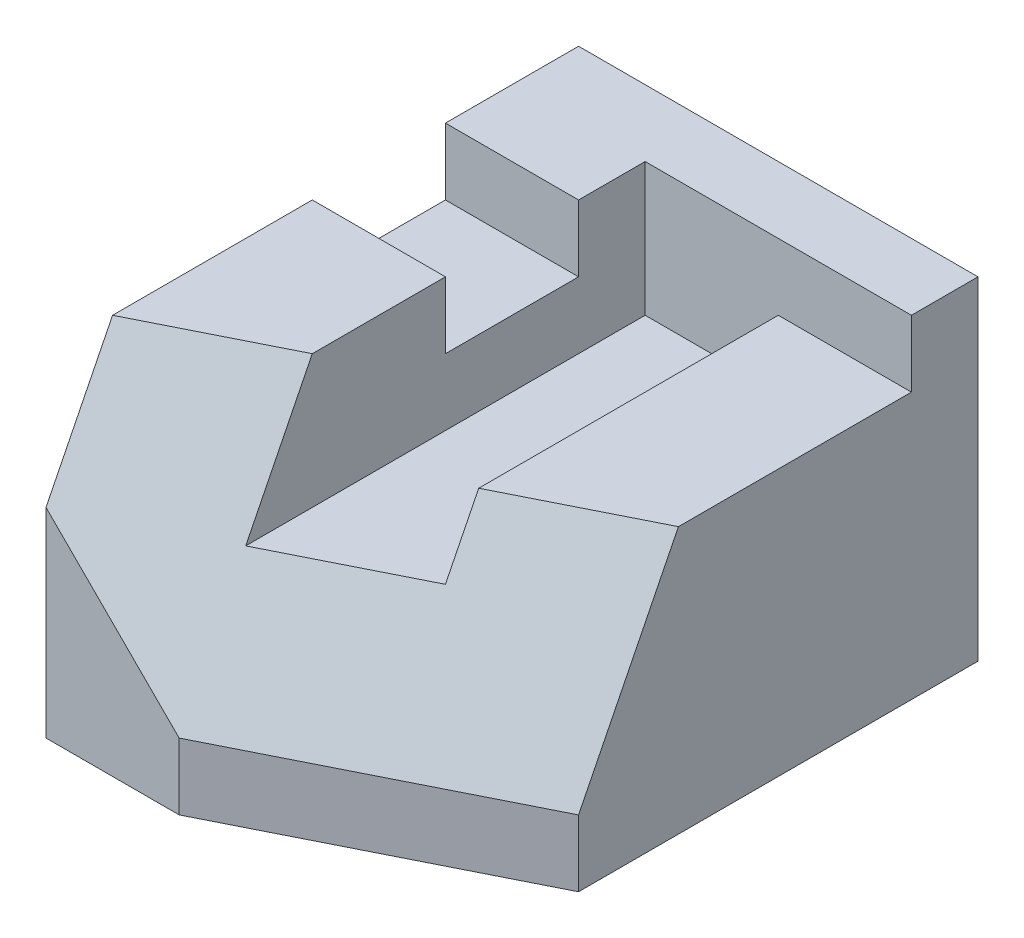
ISO-10303-21;
HEADER;
FILE_DESCRIPTION(('STEP AP214'),'2;1');
FILE_NAME('part.step','',(''),(''),'','','');
FILE_SCHEMA(('AUTOMOTIVE_DESIGN { 1 0 10303 214 1 1 1 1 }'));
ENDSEC;
DATA;
#1=APPLICATION_CONTEXT('core data for automotive mechanical design processes');
#2=APPLICATION_PROTOCOL_DEFINITION('international standard','automotive_design',2000,#1);
#3=PRODUCT_CONTEXT('',#1,'mechanical');
#4=PRODUCT('Part','Part','',(#3));
#5=PRODUCT_RELATED_PRODUCT_CATEGORY('part','',(#4));
#6=PRODUCT_DEFINITION_FORMATION('','',#4);
#7=PRODUCT_DEFINITION_CONTEXT('part definition',#1,'design');
#8=PRODUCT_DEFINITION('design','',#6,#7);
#9=PRODUCT_DEFINITION_SHAPE('','',#8);
#10=(LENGTH_UNIT() NAMED_UNIT(*) SI_UNIT(.MILLI.,.METRE.));
#11=(NAMED_UNIT(*) PLANE_ANGLE_UNIT() SI_UNIT($,.RADIAN.));
#12=(NAMED_UNIT(*) SI_UNIT($,.STERADIAN.) SOLID_ANGLE_UNIT());
#13=UNCERTAINTY_MEASURE_WITH_UNIT(LENGTH_MEASURE(1.E-05),#10,'distance_accuracy_value','');
#14=(GEOMETRIC_REPRESENTATION_CONTEXT(3) GLOBAL_UNCERTAINTY_ASSIGNED_CONTEXT((#13)) GLOBAL_UNIT_ASSIGNED_CONTEXT((#10,
#11,#12)) REPRESENTATION_CONTEXT('',''));
#15=CARTESIAN_POINT('',(0.,0.,0.));
#16=DIRECTION('',(0.,0.,1.));
#17=DIRECTION('',(1.,0.,0.));
#18=AXIS2_PLACEMENT_3D('',#15,#16,#17);
#19=CARTESIAN_POINT('',(-30.,50.,40.));
#20=DIRECTION('',(0.,0.,-1.));
#21=DIRECTION('',(-1.,0.,0.));
#22=AXIS2_PLACEMENT_3D('',#19,#20,#21);
#23=PLANE('',#22);
#24=DIRECTION('',(-0.707106781186548,0.707106781186547,0.));
#25=VECTOR('',#24,1.);
#26=CARTESIAN_POINT('',(-10.,10.,40.));
#27=LINE('',#26,#25);
#28=CARTESIAN_POINT('',(-10.,10.,40.));
#29=VERTEX_POINT('',#28);
#30=CARTESIAN_POINT('',(-30.,30.,40.));
#31=VERTEX_POINT('',#30);
#32=EDGE_CURVE('E52',#29,#31,#27,.T.);
#33=ORIENTED_EDGE('',*,*,#32,.T.);
#34=DIRECTION('',(0.,-1.,0.));
#35=VECTOR('',#34,1.);
#36=CARTESIAN_POINT('',(-30.,50.,40.));
#37=LINE('',#36,#35);
#38=CARTESIAN_POINT('',(-30.,0.,40.));
#39=VERTEX_POINT('',#38);
#40=EDGE_CURVE('E38',#31,#39,#37,.T.);
#41=ORIENTED_EDGE('',*,*,#40,.T.);
#42=DIRECTION('',(1.,0.,0.));
#43=VECTOR('',#42,1.);
#44=CARTESIAN_POINT('',(-30.,0.,40.));
#45=LINE('',#44,#43);
#46=CARTESIAN_POINT('',(-10.,0.,40.));
#47=VERTEX_POINT('',#46);
#48=EDGE_CURVE('E184',#39,#47,#45,.T.);
#49=ORIENTED_EDGE('',*,*,#48,.T.);
#50=DIRECTION('',(0.,-1.,0.));
#51=VECTOR('',#50,1.);
#52=CARTESIAN_POINT('',(-10.,70.,40.));
#53=LINE('',#52,#51);
#54=EDGE_CURVE('E199',#29,#47,#53,.T.);
#55=ORIENTED_EDGE('',*,*,#54,.F.);
#56=EDGE_LOOP('',(#33,#41,#49,#55));
#57=FACE_BOUND('',#56,.T.);
#58=ADVANCED_FACE('F34',(#57),#23,.F.);
#59=CARTESIAN_POINT('',(30.,70.,20.));
#60=DIRECTION('',(-0.447213595499958,0.,-0.894427190999916));
#61=DIRECTION('',(-0.894427190999916,0.,0.447213595499958));
#62=AXIS2_PLACEMENT_3D('',#59,#60,#61);
#63=PLANE('',#62);
#64=DIRECTION('',(-0.894427190999916,0.,0.447213595499958));
#65=VECTOR('',#64,1.);
#66=CARTESIAN_POINT('',(30.,10.,20.));
#67=LINE('',#66,#65);
#68=CARTESIAN_POINT('',(30.,10.,20.));
#69=VERTEX_POINT('',#68);
#70=EDGE_CURVE('E302',#69,#29,#67,.T.);
#71=ORIENTED_EDGE('',*,*,#70,.T.);
#72=ORIENTED_EDGE('',*,*,#54,.T.);
#73=DIRECTION('',(0.894427190999916,0.,-0.447213595499958));
#74=VECTOR('',#73,1.);
#75=CARTESIAN_POINT('',(30.,0.,20.));
#76=LINE('',#75,#74);
#77=CARTESIAN_POINT('',(30.,0.,20.));
#78=VERTEX_POINT('',#77);
#79=EDGE_CURVE('E160',#47,#78,#76,.T.);
#80=ORIENTED_EDGE('',*,*,#79,.T.);
#81=DIRECTION('',(0.,-1.,0.));
#82=VECTOR('',#81,1.);
#83=CARTESIAN_POINT('',(30.,70.,20.));
#84=LINE('',#83,#82);
#85=EDGE_CURVE('E202',#69,#78,#84,.T.);
#86=ORIENTED_EDGE('',*,*,#85,.F.);
#87=EDGE_LOOP('',(#71,#72,#80,#86));
#88=FACE_BOUND('',#87,.T.);
#89=ADVANCED_FACE('F314',(#88),#63,.F.);
#90=CARTESIAN_POINT('',(0.,50.,0.));
#91=DIRECTION('',(0.,-1.,0.));
#92=DIRECTION('',(0.,0.,-1.));
#93=AXIS2_PLACEMENT_3D('',#90,#91,#92);
#94=PLANE('',#93);
#95=DIRECTION('',(0.,0.,1.));
#96=VECTOR('',#95,1.);
#97=CARTESIAN_POINT('',(-30.,50.,40.));
#98=LINE('',#97,#96);
#99=CARTESIAN_POINT('',(-30.,50.,-40.));
#100=VERTEX_POINT('',#99);
#101=CARTESIAN_POINT('',(-30.,50.,-20.));
#102=VERTEX_POINT('',#101);
#103=EDGE_CURVE('E165',#100,#102,#98,.T.);
#104=ORIENTED_EDGE('',*,*,#103,.T.);
#105=DIRECTION('',(-1.,0.,0.));
#106=VECTOR('',#105,1.);
#107=CARTESIAN_POINT('',(40.,50.,-20.));
#108=LINE('',#107,#106);
#109=CARTESIAN_POINT('',(-10.,50.,-20.));
#110=VERTEX_POINT('',#109);
#111=EDGE_CURVE('E217',#110,#102,#108,.T.);
#112=ORIENTED_EDGE('',*,*,#111,.F.);
#113=DIRECTION('',(0.,0.,1.));
#114=VECTOR('',#113,1.);
#115=CARTESIAN_POINT('',(-10.,50.,-30.));
#116=LINE('',#115,#114);
#117=CARTESIAN_POINT('',(-10.,50.,-30.));
#118=VERTEX_POINT('',#117);
#119=EDGE_CURVE('E253',#118,#110,#116,.T.);
#120=ORIENTED_EDGE('',*,*,#119,.F.);
#121=DIRECTION('',(-1.,0.,0.));
#122=VECTOR('',#121,1.);
#123=CARTESIAN_POINT('',(-10.,50.,-30.));
#124=LINE('',#123,#122);
#125=CARTESIAN_POINT('',(30.,50.,-30.));
#126=VERTEX_POINT('',#125);
#127=EDGE_CURVE('E224',#126,#118,#124,.T.);
#128=ORIENTED_EDGE('',*,*,#127,.F.);
#129=DIRECTION('',(0.,0.,-1.));
#130=VECTOR('',#129,1.);
#131=CARTESIAN_POINT('',(30.,50.,40.));
#132=LINE('',#131,#130);
#133=CARTESIAN_POINT('',(30.,50.,-40.));
#134=VERTEX_POINT('',#133);
#135=EDGE_CURVE('E169',#126,#134,#132,.T.);
#136=ORIENTED_EDGE('',*,*,#135,.T.);
#137=DIRECTION('',(-1.,0.,0.));
#138=VECTOR('',#137,1.);
#139=CARTESIAN_POINT('',(-30.,50.,-40.));
#140=LINE('',#139,#138);
#141=EDGE_CURVE('E166',#134,#100,#140,.T.);
#142=ORIENTED_EDGE('',*,*,#141,.T.);
#143=EDGE_LOOP('',(#104,#112,#120,#128,#136,#142));
#144=FACE_BOUND('',#143,.T.);
#145=ADVANCED_FACE('F262',(#144),#94,.F.);
#146=CARTESIAN_POINT('',(30.,50.,40.));
#147=DIRECTION('',(-1.,0.,0.));
#148=DIRECTION('',(0.,0.,1.));
#149=AXIS2_PLACEMENT_3D('',#146,#147,#148);
#150=PLANE('',#149);
#151=DIRECTION('',(0.,0.,1.));
#152=VECTOR('',#151,1.);
#153=CARTESIAN_POINT('',(30.,40.,-30.));
#154=LINE('',#153,#152);
#155=CARTESIAN_POINT('',(30.,40.,-30.));
#156=VERTEX_POINT('',#155);
#157=CARTESIAN_POINT('',(30.,40.,5.));
#158=VERTEX_POINT('',#157);
#159=EDGE_CURVE('E172',#156,#158,#154,.T.);
#160=ORIENTED_EDGE('',*,*,#159,.T.);
#161=DIRECTION('',(0.,-0.894427190999916,0.447213595499958));
#162=VECTOR('',#161,1.);
#163=CARTESIAN_POINT('',(30.,40.,5.));
#164=LINE('',#163,#162);
#165=EDGE_CURVE('E292',#158,#69,#164,.T.);
#166=ORIENTED_EDGE('',*,*,#165,.T.);
#167=ORIENTED_EDGE('',*,*,#85,.T.);
#168=DIRECTION('',(0.,0.,-1.));
#169=VECTOR('',#168,1.);
#170=CARTESIAN_POINT('',(30.,0.,40.));
#171=LINE('',#170,#169);
#172=CARTESIAN_POINT('',(30.,0.,-40.));
#173=VERTEX_POINT('',#172);
#174=EDGE_CURVE('E178',#78,#173,#171,.T.);
#175=ORIENTED_EDGE('',*,*,#174,.T.);
#176=DIRECTION('',(0.,-1.,0.));
#177=VECTOR('',#176,1.);
#178=CARTESIAN_POINT('',(30.,50.,-40.));
#179=LINE('',#178,#177);
#180=EDGE_CURVE('E191',#134,#173,#179,.T.);
#181=ORIENTED_EDGE('',*,*,#180,.F.);
#182=ORIENTED_EDGE('',*,*,#135,.F.);
#183=DIRECTION('',(0.,1.,0.));
#184=VECTOR('',#183,1.);
#185=CARTESIAN_POINT('',(30.,50.,-30.));
#186=LINE('',#185,#184);
#187=EDGE_CURVE('E219',#156,#126,#186,.T.);
#188=ORIENTED_EDGE('',*,*,#187,.F.);
#189=EDGE_LOOP('',(#160,#166,#167,#175,#181,#182,#188));
#190=FACE_BOUND('',#189,.T.);
#191=ADVANCED_FACE('F36',(#190),#150,.F.);
#192=CARTESIAN_POINT('',(-30.,50.,-40.));
#193=DIRECTION('',(0.,0.,1.));
#194=DIRECTION('',(1.,0.,0.));
#195=AXIS2_PLACEMENT_3D('',#192,#193,#194);
#196=PLANE('',#195);
#197=DIRECTION('',(-1.,0.,0.));
#198=VECTOR('',#197,1.);
#199=CARTESIAN_POINT('',(-30.,0.,-40.));
#200=LINE('',#199,#198);
#201=CARTESIAN_POINT('',(-30.,0.,-40.));
#202=VERTEX_POINT('',#201);
#203=EDGE_CURVE('E180',#173,#202,#200,.T.);
#204=ORIENTED_EDGE('',*,*,#203,.T.);
#205=DIRECTION('',(0.,-1.,0.));
#206=VECTOR('',#205,1.);
#207=CARTESIAN_POINT('',(-30.,50.,-40.));
#208=LINE('',#207,#206);
#209=EDGE_CURVE('E188',#100,#202,#208,.T.);
#210=ORIENTED_EDGE('',*,*,#209,.F.);
#211=ORIENTED_EDGE('',*,*,#141,.F.);
#212=ORIENTED_EDGE('',*,*,#180,.T.);
#213=EDGE_LOOP('',(#204,#210,#211,#212));
#214=FACE_BOUND('',#213,.T.);
#215=ADVANCED_FACE('F269',(#214),#196,.F.);
#216=CARTESIAN_POINT('',(-30.,50.,40.));
#217=DIRECTION('',(1.,0.,0.));
#218=DIRECTION('',(0.,0.,-1.));
#219=AXIS2_PLACEMENT_3D('',#216,#217,#218);
#220=PLANE('',#219);
#221=ORIENTED_EDGE('',*,*,#40,.F.);
#222=DIRECTION('',(0.,0.894427190999916,-0.447213595499958));
#223=VECTOR('',#222,1.);
#224=CARTESIAN_POINT('',(-30.,30.,40.));
#225=LINE('',#224,#223);
#226=CARTESIAN_POINT('',(-30.,50.,30.));
#227=VERTEX_POINT('',#226);
#228=EDGE_CURVE('E145',#31,#227,#225,.T.);
#229=ORIENTED_EDGE('',*,*,#228,.T.);
#230=CARTESIAN_POINT('',(-30.,50.,0.));
#231=VERTEX_POINT('',#230);
#232=EDGE_CURVE('E158',#231,#227,#98,.T.);
#233=ORIENTED_EDGE('',*,*,#232,.F.);
#234=DIRECTION('',(0.,1.,0.));
#235=VECTOR('',#234,1.);
#236=CARTESIAN_POINT('',(-30.,50.,0.));
#237=LINE('',#236,#235);
#238=CARTESIAN_POINT('',(-30.,40.,0.));
#239=VERTEX_POINT('',#238);
#240=EDGE_CURVE('E214',#239,#231,#237,.T.);
#241=ORIENTED_EDGE('',*,*,#240,.F.);
#242=DIRECTION('',(0.,0.,1.));
#243=VECTOR('',#242,1.);
#244=CARTESIAN_POINT('',(-30.,40.,-20.));
#245=LINE('',#244,#243);
#246=CARTESIAN_POINT('',(-30.,40.,-20.));
#247=VERTEX_POINT('',#246);
#248=EDGE_CURVE('E212',#247,#239,#245,.T.);
#249=ORIENTED_EDGE('',*,*,#248,.F.);
#250=DIRECTION('',(0.,-1.,0.));
#251=VECTOR('',#250,1.);
#252=CARTESIAN_POINT('',(-30.,50.,-20.));
#253=LINE('',#252,#251);
#254=EDGE_CURVE('E209',#102,#247,#253,.T.);
#255=ORIENTED_EDGE('',*,*,#254,.F.);
#256=ORIENTED_EDGE('',*,*,#103,.F.);
#257=ORIENTED_EDGE('',*,*,#209,.T.);
#258=DIRECTION('',(0.,0.,1.));
#259=VECTOR('',#258,1.);
#260=CARTESIAN_POINT('',(-30.,0.,40.));
#261=LINE('',#260,#259);
#262=EDGE_CURVE('E182',#202,#39,#261,.T.);
#263=ORIENTED_EDGE('',*,*,#262,.T.);
#264=EDGE_LOOP('',(#221,#229,#233,#241,#249,#255,#256,#257,#263));
#265=FACE_BOUND('',#264,.T.);
#266=ADVANCED_FACE('F156',(#265),#220,.F.);
#267=ORIENTED_EDGE('',*,*,#232,.T.);
#268=DIRECTION('',(0.894427190999916,0.,-0.447213595499958));
#269=VECTOR('',#268,1.);
#270=CARTESIAN_POINT('',(-30.,50.,30.));
#271=LINE('',#270,#269);
#272=CARTESIAN_POINT('',(-10.,50.,20.));
#273=VERTEX_POINT('',#272);
#274=EDGE_CURVE('E142',#227,#273,#271,.T.);
#275=ORIENTED_EDGE('',*,*,#274,.T.);
#276=CARTESIAN_POINT('',(-10.,50.,0.));
#277=VERTEX_POINT('',#276);
#278=EDGE_CURVE('E238',#277,#273,#116,.T.);
#279=ORIENTED_EDGE('',*,*,#278,.F.);
#280=DIRECTION('',(-1.,0.,0.));
#281=VECTOR('',#280,1.);
#282=CARTESIAN_POINT('',(40.,50.,0.));
#283=LINE('',#282,#281);
#284=EDGE_CURVE('E164',#277,#231,#283,.T.);
#285=ORIENTED_EDGE('',*,*,#284,.T.);
#286=EDGE_LOOP('',(#267,#275,#279,#285));
#287=FACE_BOUND('',#286,.T.);
#288=ADVANCED_FACE('F163',(#287),#94,.F.);
#289=CARTESIAN_POINT('',(0.,0.,0.));
#290=DIRECTION('',(0.,-1.,0.));
#291=DIRECTION('',(0.,0.,-1.));
#292=AXIS2_PLACEMENT_3D('',#289,#290,#291);
#293=PLANE('',#292);
#294=ORIENTED_EDGE('',*,*,#79,.F.);
#295=ORIENTED_EDGE('',*,*,#48,.F.);
#296=ORIENTED_EDGE('',*,*,#262,.F.);
#297=ORIENTED_EDGE('',*,*,#203,.F.);
#298=ORIENTED_EDGE('',*,*,#174,.F.);
#299=EDGE_LOOP('',(#294,#295,#296,#297,#298));
#300=FACE_BOUND('',#299,.T.);
#301=ADVANCED_FACE('F280',(#300),#293,.T.);
#302=CARTESIAN_POINT('',(30.,40.,-30.));
#303=DIRECTION('',(0.,-1.,0.));
#304=DIRECTION('',(1.,0.,0.));
#305=AXIS2_PLACEMENT_3D('',#302,#303,#304);
#306=PLANE('',#305);
#307=DIRECTION('',(0.,0.,1.));
#308=VECTOR('',#307,1.);
#309=CARTESIAN_POINT('',(10.,40.,-30.));
#310=LINE('',#309,#308);
#311=CARTESIAN_POINT('',(10.,40.,-30.));
#312=VERTEX_POINT('',#311);
#313=CARTESIAN_POINT('',(10.,40.,15.));
#314=VERTEX_POINT('',#313);
#315=EDGE_CURVE('E245',#312,#314,#310,.T.);
#316=ORIENTED_EDGE('',*,*,#315,.T.);
#317=DIRECTION('',(0.894427190999916,0.,-0.447213595499958));
#318=VECTOR('',#317,1.);
#319=CARTESIAN_POINT('',(10.,40.,15.));
#320=LINE('',#319,#318);
#321=EDGE_CURVE('E296',#314,#158,#320,.T.);
#322=ORIENTED_EDGE('',*,*,#321,.T.);
#323=ORIENTED_EDGE('',*,*,#159,.F.);
#324=DIRECTION('',(1.,0.,0.));
#325=VECTOR('',#324,1.);
#326=CARTESIAN_POINT('',(30.,40.,-30.));
#327=LINE('',#326,#325);
#328=EDGE_CURVE('E236',#312,#156,#327,.T.);
#329=ORIENTED_EDGE('',*,*,#328,.F.);
#330=EDGE_LOOP('',(#316,#322,#323,#329));
#331=FACE_BOUND('',#330,.T.);
#332=ADVANCED_FACE('F295',(#331),#306,.F.);
#333=CARTESIAN_POINT('',(10.,40.,-30.));
#334=DIRECTION('',(1.,0.,0.));
#335=DIRECTION('',(0.,1.,0.));
#336=AXIS2_PLACEMENT_3D('',#333,#334,#335);
#337=PLANE('',#336);
#338=DIRECTION('',(0.,0.,1.));
#339=VECTOR('',#338,1.);
#340=CARTESIAN_POINT('',(10.,30.,-30.));
#341=LINE('',#340,#339);
#342=CARTESIAN_POINT('',(10.,30.,-30.));
#343=VERTEX_POINT('',#342);
#344=CARTESIAN_POINT('',(10.,30.,20.));
#345=VERTEX_POINT('',#344);
#346=EDGE_CURVE('E248',#343,#345,#341,.T.);
#347=ORIENTED_EDGE('',*,*,#346,.T.);
#348=DIRECTION('',(0.,0.894427190999916,-0.447213595499958));
#349=VECTOR('',#348,1.);
#350=CARTESIAN_POINT('',(10.,30.,20.));
#351=LINE('',#350,#349);
#352=EDGE_CURVE('E298',#345,#314,#351,.T.);
#353=ORIENTED_EDGE('',*,*,#352,.T.);
#354=ORIENTED_EDGE('',*,*,#315,.F.);
#355=DIRECTION('',(0.,1.,0.));
#356=VECTOR('',#355,1.);
#357=CARTESIAN_POINT('',(10.,40.,-30.));
#358=LINE('',#357,#356);
#359=EDGE_CURVE('E233',#343,#312,#358,.T.);
#360=ORIENTED_EDGE('',*,*,#359,.F.);
#361=EDGE_LOOP('',(#347,#353,#354,#360));
#362=FACE_BOUND('',#361,.T.);
#363=ADVANCED_FACE('F335',(#362),#337,.F.);
#364=CARTESIAN_POINT('',(10.,30.,-30.));
#365=DIRECTION('',(0.,-1.,0.));
#366=DIRECTION('',(1.,0.,0.));
#367=AXIS2_PLACEMENT_3D('',#364,#365,#366);
#368=PLANE('',#367);
#369=DIRECTION('',(0.,0.,1.));
#370=VECTOR('',#369,1.);
#371=CARTESIAN_POINT('',(-10.,30.,-30.));
#372=LINE('',#371,#370);
#373=CARTESIAN_POINT('',(-10.,30.,-30.));
#374=VERTEX_POINT('',#373);
#375=CARTESIAN_POINT('',(-10.,30.,30.));
#376=VERTEX_POINT('',#375);
#377=EDGE_CURVE('E251',#374,#376,#372,.T.);
#378=ORIENTED_EDGE('',*,*,#377,.T.);
#379=DIRECTION('',(0.894427190999916,0.,-0.447213595499958));
#380=VECTOR('',#379,1.);
#381=CARTESIAN_POINT('',(-10.,30.,30.));
#382=LINE('',#381,#380);
#383=EDGE_CURVE('E300',#376,#345,#382,.T.);
#384=ORIENTED_EDGE('',*,*,#383,.T.);
#385=ORIENTED_EDGE('',*,*,#346,.F.);
#386=DIRECTION('',(1.,0.,0.));
#387=VECTOR('',#386,1.);
#388=CARTESIAN_POINT('',(10.,30.,-30.));
#389=LINE('',#388,#387);
#390=EDGE_CURVE('E230',#374,#343,#389,.T.);
#391=ORIENTED_EDGE('',*,*,#390,.F.);
#392=EDGE_LOOP('',(#378,#384,#385,#391));
#393=FACE_BOUND('',#392,.T.);
#394=ADVANCED_FACE('F332',(#393),#368,.F.);
#395=CARTESIAN_POINT('',(-10.,30.,-30.));
#396=DIRECTION('',(-1.,0.,0.));
#397=DIRECTION('',(0.,-1.,0.));
#398=AXIS2_PLACEMENT_3D('',#395,#396,#397);
#399=PLANE('',#398);
#400=ORIENTED_EDGE('',*,*,#278,.T.);
#401=DIRECTION('',(0.,-0.894427190999916,0.447213595499958));
#402=VECTOR('',#401,1.);
#403=CARTESIAN_POINT('',(-10.,50.,20.));
#404=LINE('',#403,#402);
#405=EDGE_CURVE('E147',#273,#376,#404,.T.);
#406=ORIENTED_EDGE('',*,*,#405,.T.);
#407=ORIENTED_EDGE('',*,*,#377,.F.);
#408=DIRECTION('',(0.,-1.,0.));
#409=VECTOR('',#408,1.);
#410=CARTESIAN_POINT('',(-10.,30.,-30.));
#411=LINE('',#410,#409);
#412=EDGE_CURVE('E227',#118,#374,#411,.T.);
#413=ORIENTED_EDGE('',*,*,#412,.F.);
#414=ORIENTED_EDGE('',*,*,#119,.T.);
#415=DIRECTION('',(0.,-1.,0.));
#416=VECTOR('',#415,1.);
#417=CARTESIAN_POINT('',(-10.,30.,-20.));
#418=LINE('',#417,#416);
#419=CARTESIAN_POINT('',(-10.,40.,-20.));
#420=VERTEX_POINT('',#419);
#421=EDGE_CURVE('E12',#110,#420,#418,.T.);
#422=ORIENTED_EDGE('',*,*,#421,.T.);
#423=DIRECTION('',(0.,0.,1.));
#424=VECTOR('',#423,1.);
#425=CARTESIAN_POINT('',(-10.,40.,-30.));
#426=LINE('',#425,#424);
#427=CARTESIAN_POINT('',(-10.,40.,0.));
#428=VERTEX_POINT('',#427);
#429=EDGE_CURVE('E194',#420,#428,#426,.T.);
#430=ORIENTED_EDGE('',*,*,#429,.T.);
#431=DIRECTION('',(0.,1.,0.));
#432=VECTOR('',#431,1.);
#433=CARTESIAN_POINT('',(-10.,30.,0.));
#434=LINE('',#433,#432);
#435=EDGE_CURVE('E44',#428,#277,#434,.T.);
#436=ORIENTED_EDGE('',*,*,#435,.T.);
#437=EDGE_LOOP('',(#400,#406,#407,#413,#414,#422,#430,#436));
#438=FACE_BOUND('',#437,.T.);
#439=ADVANCED_FACE('F287',(#438),#399,.F.);
#440=CARTESIAN_POINT('',(0.,0.,-30.));
#441=DIRECTION('',(0.,0.,-1.));
#442=DIRECTION('',(-1.,0.,0.));
#443=AXIS2_PLACEMENT_3D('',#440,#441,#442);
#444=PLANE('',#443);
#445=ORIENTED_EDGE('',*,*,#187,.T.);
#446=ORIENTED_EDGE('',*,*,#127,.T.);
#447=ORIENTED_EDGE('',*,*,#412,.T.);
#448=ORIENTED_EDGE('',*,*,#390,.T.);
#449=ORIENTED_EDGE('',*,*,#359,.T.);
#450=ORIENTED_EDGE('',*,*,#328,.T.);
#451=EDGE_LOOP('',(#445,#446,#447,#448,#449,#450));
#452=FACE_BOUND('',#451,.T.);
#453=ADVANCED_FACE('F290',(#452),#444,.F.);
#454=CARTESIAN_POINT('',(40.,50.,-20.));
#455=DIRECTION('',(0.,0.,-1.));
#456=DIRECTION('',(-1.,0.,0.));
#457=AXIS2_PLACEMENT_3D('',#454,#455,#456);
#458=PLANE('',#457);
#459=ORIENTED_EDGE('',*,*,#111,.T.);
#460=ORIENTED_EDGE('',*,*,#254,.T.);
#461=DIRECTION('',(-1.,0.,0.));
#462=VECTOR('',#461,1.);
#463=CARTESIAN_POINT('',(40.,40.,-20.));
#464=LINE('',#463,#462);
#465=EDGE_CURVE('E216',#420,#247,#464,.T.);
#466=ORIENTED_EDGE('',*,*,#465,.F.);
#467=ORIENTED_EDGE('',*,*,#421,.F.);
#468=EDGE_LOOP('',(#459,#460,#466,#467));
#469=FACE_BOUND('',#468,.T.);
#470=ADVANCED_FACE('F421',(#469),#458,.F.);
#471=CARTESIAN_POINT('',(40.,50.,0.));
#472=DIRECTION('',(0.,0.,1.));
#473=DIRECTION('',(0.,-1.,0.));
#474=AXIS2_PLACEMENT_3D('',#471,#472,#473);
#475=PLANE('',#474);
#476=DIRECTION('',(-1.,0.,0.));
#477=VECTOR('',#476,1.);
#478=CARTESIAN_POINT('',(40.,40.,0.));
#479=LINE('',#478,#477);
#480=EDGE_CURVE('E60',#428,#239,#479,.T.);
#481=ORIENTED_EDGE('',*,*,#480,.T.);
#482=ORIENTED_EDGE('',*,*,#240,.T.);
#483=ORIENTED_EDGE('',*,*,#284,.F.);
#484=ORIENTED_EDGE('',*,*,#435,.F.);
#485=EDGE_LOOP('',(#481,#482,#483,#484));
#486=FACE_BOUND('',#485,.T.);
#487=ADVANCED_FACE('F414',(#486),#475,.F.);
#488=CARTESIAN_POINT('',(40.,40.,-20.));
#489=DIRECTION('',(0.,-1.,0.));
#490=DIRECTION('',(0.,0.,-1.));
#491=AXIS2_PLACEMENT_3D('',#488,#489,#490);
#492=PLANE('',#491);
#493=ORIENTED_EDGE('',*,*,#465,.T.);
#494=ORIENTED_EDGE('',*,*,#248,.T.);
#495=ORIENTED_EDGE('',*,*,#480,.F.);
#496=ORIENTED_EDGE('',*,*,#429,.F.);
#497=EDGE_LOOP('',(#493,#494,#495,#496));
#498=FACE_BOUND('',#497,.T.);
#499=ADVANCED_FACE('F405',(#498),#492,.F.);
#500=CARTESIAN_POINT('',(13.3333333333333,13.3333333333334,26.6666666666667));
#501=DIRECTION('',(-0.408248290463863,-0.408248290463864,-0.816496580927726));
#502=DIRECTION('',(0.,0.894427190999915,-0.447213595499959));
#503=AXIS2_PLACEMENT_3D('',#500,#501,#502);
#504=PLANE('',#503);
#505=ORIENTED_EDGE('',*,*,#32,.F.);
#506=ORIENTED_EDGE('',*,*,#70,.F.);
#507=ORIENTED_EDGE('',*,*,#165,.F.);
#508=ORIENTED_EDGE('',*,*,#321,.F.);
#509=ORIENTED_EDGE('',*,*,#352,.F.);
#510=ORIENTED_EDGE('',*,*,#383,.F.);
#511=ORIENTED_EDGE('',*,*,#405,.F.);
#512=ORIENTED_EDGE('',*,*,#274,.F.);
#513=ORIENTED_EDGE('',*,*,#228,.F.);
#514=EDGE_LOOP('',(#505,#506,#507,#508,#509,#510,#511,#512,#513));
#515=FACE_BOUND('',#514,.T.);
#516=ADVANCED_FACE('F144',(#515),#504,.F.);
#517=CLOSED_SHELL('',(#58,#89,#145,#191,#215,#266,#288,#301,#332,#363,#394,#439,#453,#470,#487,
#499,#516));
#518=MANIFOLD_SOLID_BREP('B2',#517);
#519=ADVANCED_BREP_SHAPE_REPRESENTATION('',(#18,#518),#14);
#520=SHAPE_DEFINITION_REPRESENTATION(#9,#519);
ENDSEC;
END-ISO-10303-21;
